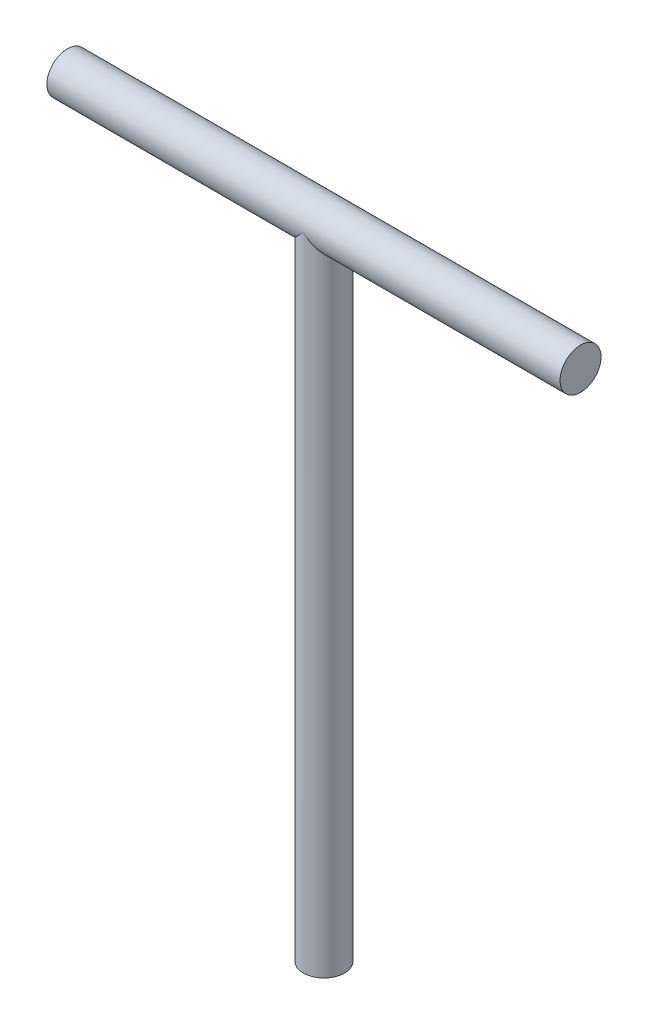
ISO-10303-21;
HEADER;
FILE_DESCRIPTION(('STEP AP214'),'2;1');
FILE_NAME('part.step','',(''),(''),'','','');
FILE_SCHEMA(('AUTOMOTIVE_DESIGN { 1 0 10303 214 1 1 1 1 }'));
ENDSEC;
DATA;
#1=APPLICATION_CONTEXT('core data for automotive mechanical design processes');
#2=APPLICATION_PROTOCOL_DEFINITION('international standard','automotive_design',2000,#1);
#3=PRODUCT_CONTEXT('',#1,'mechanical');
#4=PRODUCT('Part','Part','',(#3));
#5=PRODUCT_RELATED_PRODUCT_CATEGORY('part','',(#4));
#6=PRODUCT_DEFINITION_FORMATION('','',#4);
#7=PRODUCT_DEFINITION_CONTEXT('part definition',#1,'design');
#8=PRODUCT_DEFINITION('design','',#6,#7);
#9=PRODUCT_DEFINITION_SHAPE('','',#8);
#10=(LENGTH_UNIT() NAMED_UNIT(*) SI_UNIT(.MILLI.,.METRE.));
#11=(NAMED_UNIT(*) PLANE_ANGLE_UNIT() SI_UNIT($,.RADIAN.));
#12=(NAMED_UNIT(*) SI_UNIT($,.STERADIAN.) SOLID_ANGLE_UNIT());
#13=UNCERTAINTY_MEASURE_WITH_UNIT(LENGTH_MEASURE(1.E-05),#10,'distance_accuracy_value','');
#14=(GEOMETRIC_REPRESENTATION_CONTEXT(3) GLOBAL_UNCERTAINTY_ASSIGNED_CONTEXT((#13)) GLOBAL_UNIT_ASSIGNED_CONTEXT((#10,
#11,#12)) REPRESENTATION_CONTEXT('',''));
#15=CARTESIAN_POINT('',(0.,0.,0.));
#16=DIRECTION('',(0.,0.,1.));
#17=DIRECTION('',(1.,0.,0.));
#18=AXIS2_PLACEMENT_3D('',#15,#16,#17);
#19=CARTESIAN_POINT('',(400.,0.,0.));
#20=DIRECTION('',(-1.,0.,0.));
#21=DIRECTION('',(0.,0.,1.));
#22=AXIS2_PLACEMENT_3D('',#19,#20,#21);
#23=CYLINDRICAL_SURFACE('',#22,16.);
#24=CARTESIAN_POINT('',(200.,0.,0.));
#25=DIRECTION('',(-0.707106781186547,-0.707106781186547,0.));
#26=DIRECTION('',(-0.707106781186547,0.707106781186547,0.));
#27=AXIS2_PLACEMENT_3D('',#24,#25,#26);
#28=ELLIPSE('',#27,22.6274169979695,16.);
#29=CARTESIAN_POINT('',(200.,0.,16.));
#30=VERTEX_POINT('',#29);
#31=CARTESIAN_POINT('',(200.,0.,-16.));
#32=VERTEX_POINT('',#31);
#33=EDGE_CURVE('E45',#30,#32,#28,.F.);
#34=ORIENTED_EDGE('',*,*,#33,.T.);
#35=CARTESIAN_POINT('',(200.,0.,0.));
#36=DIRECTION('',(-0.707106781186547,0.707106781186547,0.));
#37=DIRECTION('',(-0.707106781186547,-0.707106781186547,0.));
#38=AXIS2_PLACEMENT_3D('',#35,#36,#37);
#39=ELLIPSE('',#38,22.6274169979695,16.);
#40=EDGE_CURVE('E11',#32,#30,#39,.T.);
#41=ORIENTED_EDGE('',*,*,#40,.T.);
#42=EDGE_LOOP('',(#34,#41));
#43=FACE_BOUND('',#42,.T.);
#44=CARTESIAN_POINT('',(400.,0.,0.));
#45=DIRECTION('',(1.,0.,0.));
#46=DIRECTION('',(0.,0.,-1.));
#47=AXIS2_PLACEMENT_3D('',#44,#45,#46);
#48=CIRCLE('',#47,16.);
#49=CARTESIAN_POINT('',(400.,0.,-16.));
#50=VERTEX_POINT('',#49);
#51=EDGE_CURVE('E53',#50,#50,#48,.T.);
#52=ORIENTED_EDGE('',*,*,#51,.F.);
#53=EDGE_LOOP('',(#52));
#54=FACE_BOUND('',#53,.T.);
#55=CARTESIAN_POINT('',(0.,0.,0.));
#56=DIRECTION('',(1.,0.,0.));
#57=DIRECTION('',(0.,0.,-1.));
#58=AXIS2_PLACEMENT_3D('',#55,#56,#57);
#59=CIRCLE('',#58,16.);
#60=CARTESIAN_POINT('',(0.,0.,-16.));
#61=VERTEX_POINT('',#60);
#62=EDGE_CURVE('E62',#61,#61,#59,.T.);
#63=ORIENTED_EDGE('',*,*,#62,.T.);
#64=EDGE_LOOP('',(#63));
#65=FACE_BOUND('',#64,.T.);
#66=ADVANCED_FACE('F38',(#43,#54,#65),#23,.T.);
#67=CARTESIAN_POINT('',(400.,0.,0.));
#68=DIRECTION('',(1.,0.,0.));
#69=DIRECTION('',(0.,0.,-1.));
#70=AXIS2_PLACEMENT_3D('',#67,#68,#69);
#71=PLANE('',#70);
#72=ORIENTED_EDGE('',*,*,#51,.T.);
#73=EDGE_LOOP('',(#72));
#74=FACE_BOUND('',#73,.T.);
#75=ADVANCED_FACE('F56',(#74),#71,.T.);
#76=CARTESIAN_POINT('',(0.,0.,0.));
#77=DIRECTION('',(1.,0.,0.));
#78=DIRECTION('',(0.,0.,-1.));
#79=AXIS2_PLACEMENT_3D('',#76,#77,#78);
#80=PLANE('',#79);
#81=ORIENTED_EDGE('',*,*,#62,.F.);
#82=EDGE_LOOP('',(#81));
#83=FACE_BOUND('',#82,.T.);
#84=ADVANCED_FACE('F78',(#83),#80,.F.);
#85=CARTESIAN_POINT('',(200.,-500.,0.));
#86=DIRECTION('',(0.,1.,0.));
#87=DIRECTION('',(0.,0.,1.));
#88=AXIS2_PLACEMENT_3D('',#85,#86,#87);
#89=CYLINDRICAL_SURFACE('',#88,16.);
#90=CARTESIAN_POINT('',(200.,-500.,0.));
#91=DIRECTION('',(0.,1.,0.));
#92=DIRECTION('',(0.,0.,1.));
#93=AXIS2_PLACEMENT_3D('',#90,#91,#92);
#94=CIRCLE('',#93,16.);
#95=CARTESIAN_POINT('',(200.,-500.,16.));
#96=VERTEX_POINT('',#95);
#97=EDGE_CURVE('E64',#96,#96,#94,.T.);
#98=ORIENTED_EDGE('',*,*,#97,.T.);
#99=EDGE_LOOP('',(#98));
#100=FACE_BOUND('',#99,.T.);
#101=ORIENTED_EDGE('',*,*,#40,.F.);
#102=ORIENTED_EDGE('',*,*,#33,.F.);
#103=EDGE_LOOP('',(#101,#102));
#104=FACE_BOUND('',#103,.T.);
#105=ADVANCED_FACE('F51',(#100,#104),#89,.T.);
#106=CARTESIAN_POINT('',(200.,-500.,0.));
#107=DIRECTION('',(0.,1.,0.));
#108=DIRECTION('',(0.,0.,1.));
#109=AXIS2_PLACEMENT_3D('',#106,#107,#108);
#110=PLANE('',#109);
#111=ORIENTED_EDGE('',*,*,#97,.F.);
#112=EDGE_LOOP('',(#111));
#113=FACE_BOUND('',#112,.T.);
#114=ADVANCED_FACE('F72',(#113),#110,.F.);
#115=CLOSED_SHELL('',(#66,#75,#84,#105,#114));
#116=MANIFOLD_SOLID_BREP('B2',#115);
#117=ADVANCED_BREP_SHAPE_REPRESENTATION('',(#18,#116),#14);
#118=SHAPE_DEFINITION_REPRESENTATION(#9,#117);
ENDSEC;
END-ISO-10303-21;
